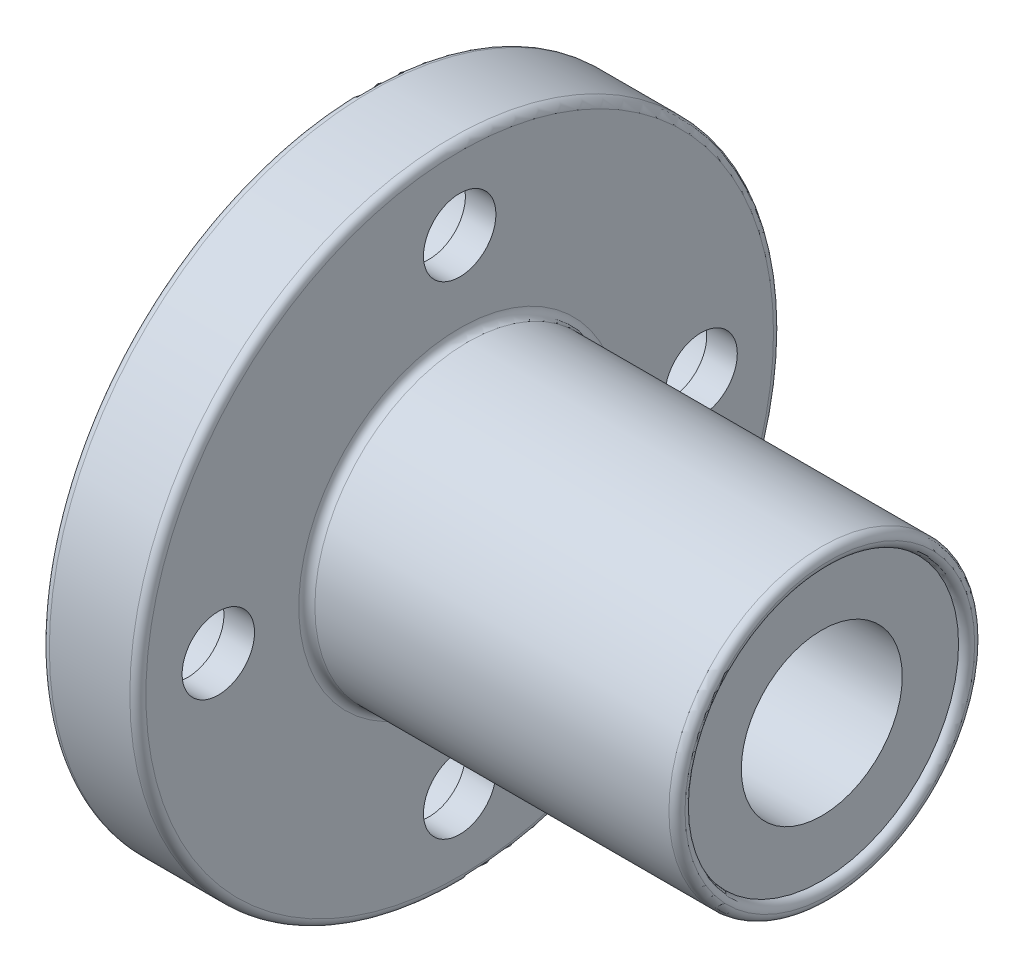
ISO-10303-21;
HEADER;
FILE_DESCRIPTION(('STEP AP214'),'2;1');
FILE_NAME('part.step','',(''),(''),'','','');
FILE_SCHEMA(('AUTOMOTIVE_DESIGN { 1 0 10303 214 1 1 1 1 }'));
ENDSEC;
DATA;
#1=APPLICATION_CONTEXT('core data for automotive mechanical design processes');
#2=APPLICATION_PROTOCOL_DEFINITION('international standard','automotive_design',2000,#1);
#3=PRODUCT_CONTEXT('',#1,'mechanical');
#4=PRODUCT('Part','Part','',(#3));
#5=PRODUCT_RELATED_PRODUCT_CATEGORY('part','',(#4));
#6=PRODUCT_DEFINITION_FORMATION('','',#4);
#7=PRODUCT_DEFINITION_CONTEXT('part definition',#1,'design');
#8=PRODUCT_DEFINITION('design','',#6,#7);
#9=PRODUCT_DEFINITION_SHAPE('','',#8);
#10=(LENGTH_UNIT() NAMED_UNIT(*) SI_UNIT(.MILLI.,.METRE.));
#11=(NAMED_UNIT(*) PLANE_ANGLE_UNIT() SI_UNIT($,.RADIAN.));
#12=(NAMED_UNIT(*) SI_UNIT($,.STERADIAN.) SOLID_ANGLE_UNIT());
#13=UNCERTAINTY_MEASURE_WITH_UNIT(LENGTH_MEASURE(1.E-05),#10,'distance_accuracy_value','');
#14=(GEOMETRIC_REPRESENTATION_CONTEXT(3) GLOBAL_UNCERTAINTY_ASSIGNED_CONTEXT((#13)) GLOBAL_UNIT_ASSIGNED_CONTEXT((#10,
#11,#12)) REPRESENTATION_CONTEXT('',''));
#15=CARTESIAN_POINT('',(0.,0.,0.));
#16=DIRECTION('',(0.,0.,1.));
#17=DIRECTION('',(1.,0.,0.));
#18=AXIS2_PLACEMENT_3D('',#15,#16,#17);
#19=CARTESIAN_POINT('',(6.,0.,0.));
#20=DIRECTION('',(-1.,0.,0.));
#21=DIRECTION('',(0.,0.,1.));
#22=AXIS2_PLACEMENT_3D('',#19,#20,#21);
#23=CYLINDRICAL_SURFACE('',#22,5.);
#24=CARTESIAN_POINT('',(28.5,0.,0.));
#25=DIRECTION('',(1.,0.,0.));
#26=DIRECTION('',(0.,0.,-1.));
#27=AXIS2_PLACEMENT_3D('',#24,#25,#26);
#28=CIRCLE('',#27,5.);
#29=CARTESIAN_POINT('',(28.5,0.,-5.));
#30=VERTEX_POINT('',#29);
#31=EDGE_CURVE('E85',#30,#30,#28,.T.);
#32=ORIENTED_EDGE('',*,*,#31,.T.);
#33=EDGE_LOOP('',(#32));
#34=FACE_BOUND('',#33,.T.);
#35=CARTESIAN_POINT('',(0.5,0.,0.));
#36=DIRECTION('',(-1.,0.,0.));
#37=DIRECTION('',(0.,0.,1.));
#38=AXIS2_PLACEMENT_3D('',#35,#36,#37);
#39=CIRCLE('',#38,5.);
#40=CARTESIAN_POINT('',(0.5,0.,5.));
#41=VERTEX_POINT('',#40);
#42=EDGE_CURVE('E67',#41,#41,#39,.T.);
#43=ORIENTED_EDGE('',*,*,#42,.T.);
#44=EDGE_LOOP('',(#43));
#45=FACE_BOUND('',#44,.T.);
#46=ADVANCED_FACE('F63',(#34,#45),#23,.F.);
#47=CARTESIAN_POINT('',(14.1,1.57116660247941E-13,-15.));
#48=DIRECTION('',(-1.,0.,0.));
#49=DIRECTION('',(0.,0.,1.));
#50=AXIS2_PLACEMENT_3D('',#47,#48,#49);
#51=CYLINDRICAL_SURFACE('',#50,2.25);
#52=CARTESIAN_POINT('',(6.,1.57116660247941E-13,-15.));
#53=DIRECTION('',(1.,0.,0.));
#54=DIRECTION('',(0.,0.,-1.));
#55=AXIS2_PLACEMENT_3D('',#52,#53,#54);
#56=CIRCLE('',#55,2.25);
#57=CARTESIAN_POINT('',(6.,1.57116660247941E-13,-17.25));
#58=VERTEX_POINT('',#57);
#59=EDGE_CURVE('E107',#58,#58,#56,.T.);
#60=ORIENTED_EDGE('',*,*,#59,.T.);
#61=EDGE_LOOP('',(#60));
#62=FACE_BOUND('',#61,.T.);
#63=CARTESIAN_POINT('',(4.1,1.57116660247941E-13,-15.));
#64=DIRECTION('',(-1.,0.,0.));
#65=DIRECTION('',(0.,0.,1.));
#66=AXIS2_PLACEMENT_3D('',#63,#64,#65);
#67=CIRCLE('',#66,2.25);
#68=CARTESIAN_POINT('',(4.1,1.57116660247941E-13,-12.75));
#69=VERTEX_POINT('',#68);
#70=EDGE_CURVE('E125',#69,#69,#67,.T.);
#71=ORIENTED_EDGE('',*,*,#70,.T.);
#72=EDGE_LOOP('',(#71));
#73=FACE_BOUND('',#72,.T.);
#74=ADVANCED_FACE('F181',(#62,#73),#51,.F.);
#75=CARTESIAN_POINT('',(14.1,15.,0.));
#76=DIRECTION('',(-1.,0.,0.));
#77=DIRECTION('',(0.,0.,1.));
#78=AXIS2_PLACEMENT_3D('',#75,#76,#77);
#79=CYLINDRICAL_SURFACE('',#78,2.25);
#80=CARTESIAN_POINT('',(6.,15.,0.));
#81=DIRECTION('',(1.,0.,0.));
#82=DIRECTION('',(0.,0.,-1.));
#83=AXIS2_PLACEMENT_3D('',#80,#81,#82);
#84=CIRCLE('',#83,2.25);
#85=CARTESIAN_POINT('',(6.,15.,-2.25));
#86=VERTEX_POINT('',#85);
#87=EDGE_CURVE('E138',#86,#86,#84,.T.);
#88=ORIENTED_EDGE('',*,*,#87,.T.);
#89=EDGE_LOOP('',(#88));
#90=FACE_BOUND('',#89,.T.);
#91=CARTESIAN_POINT('',(4.1,15.,0.));
#92=DIRECTION('',(-1.,0.,0.));
#93=DIRECTION('',(0.,0.,1.));
#94=AXIS2_PLACEMENT_3D('',#91,#92,#93);
#95=CIRCLE('',#94,2.25);
#96=CARTESIAN_POINT('',(4.1,15.,2.25));
#97=VERTEX_POINT('',#96);
#98=EDGE_CURVE('E116',#97,#97,#95,.T.);
#99=ORIENTED_EDGE('',*,*,#98,.T.);
#100=EDGE_LOOP('',(#99));
#101=FACE_BOUND('',#100,.T.);
#102=ADVANCED_FACE('F187',(#90,#101),#79,.F.);
#103=CARTESIAN_POINT('',(14.1,0.,15.));
#104=DIRECTION('',(-1.,0.,0.));
#105=DIRECTION('',(0.,0.,1.));
#106=AXIS2_PLACEMENT_3D('',#103,#104,#105);
#107=CYLINDRICAL_SURFACE('',#106,2.25);
#108=CARTESIAN_POINT('',(6.,0.,15.));
#109=DIRECTION('',(1.,0.,0.));
#110=DIRECTION('',(0.,0.,-1.));
#111=AXIS2_PLACEMENT_3D('',#108,#109,#110);
#112=CIRCLE('',#111,2.25);
#113=CARTESIAN_POINT('',(6.,0.,12.75));
#114=VERTEX_POINT('',#113);
#115=EDGE_CURVE('E141',#114,#114,#112,.T.);
#116=ORIENTED_EDGE('',*,*,#115,.T.);
#117=EDGE_LOOP('',(#116));
#118=FACE_BOUND('',#117,.T.);
#119=CARTESIAN_POINT('',(4.1,0.,15.));
#120=DIRECTION('',(-1.,0.,0.));
#121=DIRECTION('',(0.,0.,1.));
#122=AXIS2_PLACEMENT_3D('',#119,#120,#121);
#123=CIRCLE('',#122,2.25);
#124=CARTESIAN_POINT('',(4.1,0.,17.25));
#125=VERTEX_POINT('',#124);
#126=EDGE_CURVE('E103',#125,#125,#123,.T.);
#127=ORIENTED_EDGE('',*,*,#126,.T.);
#128=EDGE_LOOP('',(#127));
#129=FACE_BOUND('',#128,.T.);
#130=ADVANCED_FACE('F231',(#118,#129),#107,.F.);
#131=CARTESIAN_POINT('',(14.1,-15.,-1.04744440165294E-13));
#132=DIRECTION('',(-1.,0.,0.));
#133=DIRECTION('',(0.,0.,1.));
#134=AXIS2_PLACEMENT_3D('',#131,#132,#133);
#135=CYLINDRICAL_SURFACE('',#134,2.25);
#136=CARTESIAN_POINT('',(6.,-15.,-1.04744440165294E-13));
#137=DIRECTION('',(1.,0.,0.));
#138=DIRECTION('',(0.,0.,-1.));
#139=AXIS2_PLACEMENT_3D('',#136,#137,#138);
#140=CIRCLE('',#139,2.25);
#141=CARTESIAN_POINT('',(6.,-15.,-2.2500000000001));
#142=VERTEX_POINT('',#141);
#143=EDGE_CURVE('E144',#142,#142,#140,.T.);
#144=ORIENTED_EDGE('',*,*,#143,.T.);
#145=EDGE_LOOP('',(#144));
#146=FACE_BOUND('',#145,.T.);
#147=CARTESIAN_POINT('',(4.1,-15.,-1.04744440165294E-13));
#148=DIRECTION('',(-1.,0.,0.));
#149=DIRECTION('',(0.,0.,1.));
#150=AXIS2_PLACEMENT_3D('',#147,#148,#149);
#151=CIRCLE('',#150,2.25);
#152=CARTESIAN_POINT('',(4.1,-15.,2.24999999999989));
#153=VERTEX_POINT('',#152);
#154=EDGE_CURVE('E99',#153,#153,#151,.T.);
#155=ORIENTED_EDGE('',*,*,#154,.T.);
#156=EDGE_LOOP('',(#155));
#157=FACE_BOUND('',#156,.T.);
#158=ADVANCED_FACE('F227',(#146,#157),#135,.F.);
#159=CARTESIAN_POINT('',(6.,0.,0.));
#160=DIRECTION('',(1.,0.,0.));
#161=DIRECTION('',(0.,0.,-1.));
#162=AXIS2_PLACEMENT_3D('',#159,#160,#161);
#163=PLANE('',#162);
#164=CARTESIAN_POINT('',(6.,0.,0.));
#165=DIRECTION('',(1.,0.,0.));
#166=DIRECTION('',(0.,0.,-1.));
#167=AXIS2_PLACEMENT_3D('',#164,#165,#166);
#168=CIRCLE('',#167,19.5);
#169=CARTESIAN_POINT('',(6.,0.,-19.5));
#170=VERTEX_POINT('',#169);
#171=EDGE_CURVE('E76',#170,#170,#168,.T.);
#172=ORIENTED_EDGE('',*,*,#171,.T.);
#173=EDGE_LOOP('',(#172));
#174=FACE_BOUND('',#173,.T.);
#175=CARTESIAN_POINT('',(6.,0.,0.));
#176=DIRECTION('',(1.,0.,0.));
#177=DIRECTION('',(0.,0.,-1.));
#178=AXIS2_PLACEMENT_3D('',#175,#176,#177);
#179=CIRCLE('',#178,10.);
#180=CARTESIAN_POINT('',(6.,0.,-10.));
#181=VERTEX_POINT('',#180);
#182=EDGE_CURVE('E158',#181,#181,#179,.F.);
#183=ORIENTED_EDGE('',*,*,#182,.T.);
#184=EDGE_LOOP('',(#183));
#185=FACE_BOUND('',#184,.T.);
#186=ORIENTED_EDGE('',*,*,#143,.F.);
#187=EDGE_LOOP('',(#186));
#188=FACE_BOUND('',#187,.T.);
#189=ORIENTED_EDGE('',*,*,#115,.F.);
#190=EDGE_LOOP('',(#189));
#191=FACE_BOUND('',#190,.T.);
#192=ORIENTED_EDGE('',*,*,#87,.F.);
#193=EDGE_LOOP('',(#192));
#194=FACE_BOUND('',#193,.T.);
#195=ORIENTED_EDGE('',*,*,#59,.F.);
#196=EDGE_LOOP('',(#195));
#197=FACE_BOUND('',#196,.T.);
#198=ADVANCED_FACE('F163',(#174,#185,#188,#191,#194,#197),#163,.T.);
#199=CARTESIAN_POINT('',(6.,0.,0.));
#200=DIRECTION('',(-1.,0.,0.));
#201=DIRECTION('',(0.,0.,1.));
#202=AXIS2_PLACEMENT_3D('',#199,#200,#201);
#203=CYLINDRICAL_SURFACE('',#202,20.);
#204=CARTESIAN_POINT('',(0.5,0.,0.));
#205=DIRECTION('',(1.,0.,0.));
#206=DIRECTION('',(0.,0.,-1.));
#207=AXIS2_PLACEMENT_3D('',#204,#205,#206);
#208=CIRCLE('',#207,20.);
#209=CARTESIAN_POINT('',(0.5,0.,-20.));
#210=VERTEX_POINT('',#209);
#211=EDGE_CURVE('E152',#210,#210,#208,.T.);
#212=ORIENTED_EDGE('',*,*,#211,.T.);
#213=EDGE_LOOP('',(#212));
#214=FACE_BOUND('',#213,.T.);
#215=CARTESIAN_POINT('',(5.5,0.,0.));
#216=DIRECTION('',(1.,0.,0.));
#217=DIRECTION('',(0.,0.,-1.));
#218=AXIS2_PLACEMENT_3D('',#215,#216,#217);
#219=CIRCLE('',#218,20.);
#220=CARTESIAN_POINT('',(5.5,0.,-20.));
#221=VERTEX_POINT('',#220);
#222=EDGE_CURVE('E147',#221,#221,#219,.F.);
#223=ORIENTED_EDGE('',*,*,#222,.T.);
#224=EDGE_LOOP('',(#223));
#225=FACE_BOUND('',#224,.T.);
#226=ADVANCED_FACE('F194',(#214,#225),#203,.T.);
#227=CARTESIAN_POINT('',(0.,0.,0.));
#228=DIRECTION('',(1.,0.,0.));
#229=DIRECTION('',(0.,0.,-1.));
#230=AXIS2_PLACEMENT_3D('',#227,#228,#229);
#231=PLANE('',#230);
#232=CARTESIAN_POINT('',(0.,0.,0.));
#233=DIRECTION('',(1.,0.,0.));
#234=DIRECTION('',(0.,0.,-1.));
#235=AXIS2_PLACEMENT_3D('',#232,#233,#234);
#236=CIRCLE('',#235,8.5);
#237=CARTESIAN_POINT('',(0.,0.,-8.5));
#238=VERTEX_POINT('',#237);
#239=EDGE_CURVE('E92',#238,#238,#236,.T.);
#240=ORIENTED_EDGE('',*,*,#239,.T.);
#241=EDGE_LOOP('',(#240));
#242=FACE_BOUND('',#241,.T.);
#243=CARTESIAN_POINT('',(0.,0.,0.));
#244=DIRECTION('',(1.,0.,0.));
#245=DIRECTION('',(0.,0.,-1.));
#246=AXIS2_PLACEMENT_3D('',#243,#244,#245);
#247=CIRCLE('',#246,19.5);
#248=CARTESIAN_POINT('',(0.,0.,-19.5));
#249=VERTEX_POINT('',#248);
#250=EDGE_CURVE('E155',#249,#249,#247,.F.);
#251=ORIENTED_EDGE('',*,*,#250,.T.);
#252=EDGE_LOOP('',(#251));
#253=FACE_BOUND('',#252,.T.);
#254=CARTESIAN_POINT('',(0.,-15.,-1.04744440165294E-13));
#255=DIRECTION('',(-1.,0.,0.));
#256=DIRECTION('',(0.,0.,1.));
#257=AXIS2_PLACEMENT_3D('',#254,#255,#256);
#258=CIRCLE('',#257,3.75);
#259=CARTESIAN_POINT('',(0.,-15.,3.74999999999989));
#260=VERTEX_POINT('',#259);
#261=EDGE_CURVE('E102',#260,#260,#258,.T.);
#262=ORIENTED_EDGE('',*,*,#261,.F.);
#263=EDGE_LOOP('',(#262));
#264=FACE_BOUND('',#263,.T.);
#265=CARTESIAN_POINT('',(0.,0.,15.));
#266=DIRECTION('',(-1.,0.,0.));
#267=DIRECTION('',(0.,0.,1.));
#268=AXIS2_PLACEMENT_3D('',#265,#266,#267);
#269=CIRCLE('',#268,3.75);
#270=CARTESIAN_POINT('',(0.,0.,18.75));
#271=VERTEX_POINT('',#270);
#272=EDGE_CURVE('E110',#271,#271,#269,.T.);
#273=ORIENTED_EDGE('',*,*,#272,.F.);
#274=EDGE_LOOP('',(#273));
#275=FACE_BOUND('',#274,.T.);
#276=CARTESIAN_POINT('',(0.,15.,0.));
#277=DIRECTION('',(-1.,0.,0.));
#278=DIRECTION('',(0.,0.,1.));
#279=AXIS2_PLACEMENT_3D('',#276,#277,#278);
#280=CIRCLE('',#279,3.75);
#281=CARTESIAN_POINT('',(0.,15.,3.75));
#282=VERTEX_POINT('',#281);
#283=EDGE_CURVE('E119',#282,#282,#280,.T.);
#284=ORIENTED_EDGE('',*,*,#283,.F.);
#285=EDGE_LOOP('',(#284));
#286=FACE_BOUND('',#285,.T.);
#287=CARTESIAN_POINT('',(0.,1.57116660247941E-13,-15.));
#288=DIRECTION('',(-1.,0.,0.));
#289=DIRECTION('',(0.,0.,1.));
#290=AXIS2_PLACEMENT_3D('',#287,#288,#289);
#291=CIRCLE('',#290,3.75);
#292=CARTESIAN_POINT('',(0.,1.57116660247941E-13,-11.25));
#293=VERTEX_POINT('',#292);
#294=EDGE_CURVE('E128',#293,#293,#291,.T.);
#295=ORIENTED_EDGE('',*,*,#294,.F.);
#296=EDGE_LOOP('',(#295));
#297=FACE_BOUND('',#296,.T.);
#298=ADVANCED_FACE('F192',(#242,#253,#264,#275,#286,#297),#231,.F.);
#299=CARTESIAN_POINT('',(29.,0.,0.));
#300=DIRECTION('',(-1.,0.,0.));
#301=DIRECTION('',(0.,0.,1.));
#302=AXIS2_PLACEMENT_3D('',#299,#300,#301);
#303=CYLINDRICAL_SURFACE('',#302,9.5);
#304=CARTESIAN_POINT('',(6.5,0.,0.));
#305=DIRECTION('',(1.,0.,0.));
#306=DIRECTION('',(0.,0.,-1.));
#307=AXIS2_PLACEMENT_3D('',#304,#305,#306);
#308=CIRCLE('',#307,9.5);
#309=CARTESIAN_POINT('',(6.5,0.,9.5));
#310=VERTEX_POINT('',#309);
#311=EDGE_CURVE('E11',#310,#310,#308,.T.);
#312=CARTESIAN_POINT('',(28.5,0.,0.));
#313=DIRECTION('',(1.,0.,0.));
#314=DIRECTION('',(0.,0.,-1.));
#315=AXIS2_PLACEMENT_3D('',#312,#313,#314);
#316=CIRCLE('',#315,9.5);
#317=CARTESIAN_POINT('',(28.5,0.,9.5));
#318=VERTEX_POINT('',#317);
#319=EDGE_CURVE('E71',#318,#318,#316,.F.);
#320=CARTESIAN_POINT('',(6.5,0.,9.5));
#321=CARTESIAN_POINT('',(6.72916666666667,0.,9.5));
#322=CARTESIAN_POINT('',(6.95833333333333,0.,9.5));
#323=CARTESIAN_POINT('',(7.41666666666667,0.,9.5));
#324=CARTESIAN_POINT('',(7.64583333333333,0.,9.5));
#325=CARTESIAN_POINT('',(8.10416666666667,0.,9.5));
#326=CARTESIAN_POINT('',(8.33333333333333,0.,9.5));
#327=CARTESIAN_POINT('',(8.79166666666667,0.,9.5));
#328=CARTESIAN_POINT('',(9.02083333333333,0.,9.5));
#329=CARTESIAN_POINT('',(9.47916666666667,0.,9.5));
#330=CARTESIAN_POINT('',(9.70833333333333,0.,9.5));
#331=CARTESIAN_POINT('',(10.1666666666667,0.,9.5));
#332=CARTESIAN_POINT('',(10.3958333333333,0.,9.5));
#333=CARTESIAN_POINT('',(10.8541666666667,0.,9.5));
#334=CARTESIAN_POINT('',(11.0833333333333,0.,9.5));
#335=CARTESIAN_POINT('',(11.5416666666667,0.,9.5));
#336=CARTESIAN_POINT('',(11.7708333333333,0.,9.5));
#337=CARTESIAN_POINT('',(12.2291666666667,0.,9.5));
#338=CARTESIAN_POINT('',(12.4583333333333,0.,9.5));
#339=CARTESIAN_POINT('',(12.9166666666667,0.,9.5));
#340=CARTESIAN_POINT('',(13.1458333333333,0.,9.5));
#341=CARTESIAN_POINT('',(13.6041666666667,0.,9.5));
#342=CARTESIAN_POINT('',(13.8333333333333,0.,9.5));
#343=CARTESIAN_POINT('',(14.2916666666667,0.,9.5));
#344=CARTESIAN_POINT('',(14.5208333333333,0.,9.5));
#345=CARTESIAN_POINT('',(14.9791666666667,0.,9.5));
#346=CARTESIAN_POINT('',(15.2083333333333,0.,9.5));
#347=CARTESIAN_POINT('',(15.6666666666667,0.,9.5));
#348=CARTESIAN_POINT('',(15.8958333333333,0.,9.5));
#349=CARTESIAN_POINT('',(16.3541666666667,0.,9.5));
#350=CARTESIAN_POINT('',(16.5833333333333,0.,9.5));
#351=CARTESIAN_POINT('',(17.0416666666667,0.,9.5));
#352=CARTESIAN_POINT('',(17.2708333333333,0.,9.5));
#353=CARTESIAN_POINT('',(17.7291666666667,0.,9.5));
#354=CARTESIAN_POINT('',(17.9583333333333,0.,9.5));
#355=CARTESIAN_POINT('',(18.4166666666667,0.,9.5));
#356=CARTESIAN_POINT('',(18.6458333333333,0.,9.5));
#357=CARTESIAN_POINT('',(19.1041666666667,0.,9.5));
#358=CARTESIAN_POINT('',(19.3333333333333,0.,9.5));
#359=CARTESIAN_POINT('',(19.7916666666667,0.,9.5));
#360=CARTESIAN_POINT('',(20.0208333333333,0.,9.5));
#361=CARTESIAN_POINT('',(20.4791666666667,0.,9.5));
#362=CARTESIAN_POINT('',(20.7083333333333,0.,9.5));
#363=CARTESIAN_POINT('',(21.1666666666667,0.,9.5));
#364=CARTESIAN_POINT('',(21.3958333333333,0.,9.5));
#365=CARTESIAN_POINT('',(21.8541666666667,0.,9.5));
#366=CARTESIAN_POINT('',(22.0833333333333,0.,9.5));
#367=CARTESIAN_POINT('',(22.5416666666667,0.,9.5));
#368=CARTESIAN_POINT('',(22.7708333333333,0.,9.5));
#369=CARTESIAN_POINT('',(23.2291666666667,0.,9.5));
#370=CARTESIAN_POINT('',(23.4583333333333,0.,9.5));
#371=CARTESIAN_POINT('',(23.9166666666667,0.,9.5));
#372=CARTESIAN_POINT('',(24.1458333333333,0.,9.5));
#373=CARTESIAN_POINT('',(24.6041666666667,0.,9.5));
#374=CARTESIAN_POINT('',(24.8333333333333,0.,9.5));
#375=CARTESIAN_POINT('',(25.2916666666667,0.,9.5));
#376=CARTESIAN_POINT('',(25.5208333333333,0.,9.5));
#377=CARTESIAN_POINT('',(25.9791666666667,0.,9.5));
#378=CARTESIAN_POINT('',(26.2083333333333,0.,9.5));
#379=CARTESIAN_POINT('',(26.6666666666667,0.,9.5));
#380=CARTESIAN_POINT('',(26.8958333333333,0.,9.5));
#381=CARTESIAN_POINT('',(27.3541666666667,0.,9.5));
#382=CARTESIAN_POINT('',(27.5833333333333,0.,9.5));
#383=CARTESIAN_POINT('',(28.0416666666667,0.,9.5));
#384=CARTESIAN_POINT('',(28.2708333333333,0.,9.5));
#385=CARTESIAN_POINT('',(28.5,0.,9.5));
#386=B_SPLINE_CURVE_WITH_KNOTS('',3,(#320,#321,#322,#323,#324,#325,#326,#327,#328,#329,#330,
#331,#332,#333,#334,#335,#336,#337,#338,#339,#340,#341,#342,#343,#344,#345,#346,#347,#348,#349,
#350,#351,#352,#353,#354,#355,#356,#357,#358,#359,#360,#361,#362,#363,#364,#365,#366,#367,#368,
#369,#370,#371,#372,#373,#374,#375,#376,#377,#378,#379,#380,#381,#382,#383,#384,#385),
.UNSPECIFIED.,.F.,.F.,(4,2,2,2,2,2,2,2,2,2,2,2,2,2,2,2,2,2,2,2,2,2,2,2,2,2,2,2,2,2,2,2,4),(0.,
0.687500000000001,1.375,2.0625,2.75,3.4375,4.125,4.8125,5.5,6.1875,6.875,7.5625,8.25,8.9375,
9.625,10.3125,11.,11.6875,12.375,13.0625,13.75,14.4375,15.125,15.8125,16.5,17.1875,17.875,
18.5625,19.25,19.9375,20.625,21.3125,22.),.UNSPECIFIED.);
#387=EDGE_CURVE('BSEAM213',#310,#318,#386,.T.);
#388=ORIENTED_EDGE('',*,*,#311,.T.);
#389=ORIENTED_EDGE('',*,*,#319,.T.);
#390=ORIENTED_EDGE('',*,*,#387,.T.);
#391=ORIENTED_EDGE('',*,*,#387,.F.);
#392=EDGE_LOOP('',(#388,#390,#389,#391));
#393=FACE_BOUND('',#392,.T.);
#394=ADVANCED_FACE('F213',(#393),#303,.T.);
#395=CARTESIAN_POINT('',(4.1,-15.,-1.04744440165294E-13));
#396=DIRECTION('',(-1.,0.,0.));
#397=DIRECTION('',(0.,0.,1.));
#398=AXIS2_PLACEMENT_3D('',#395,#396,#397);
#399=CYLINDRICAL_SURFACE('',#398,3.75);
#400=CARTESIAN_POINT('',(4.1,-15.,-1.04744440165294E-13));
#401=DIRECTION('',(-1.,0.,0.));
#402=DIRECTION('',(0.,0.,1.));
#403=AXIS2_PLACEMENT_3D('',#400,#401,#402);
#404=CIRCLE('',#403,3.75);
#405=CARTESIAN_POINT('',(4.1,-15.,3.74999999999989));
#406=VERTEX_POINT('',#405);
#407=EDGE_CURVE('E104',#406,#406,#404,.T.);
#408=ORIENTED_EDGE('',*,*,#407,.F.);
#409=EDGE_LOOP('',(#408));
#410=FACE_BOUND('',#409,.T.);
#411=ORIENTED_EDGE('',*,*,#261,.T.);
#412=EDGE_LOOP('',(#411));
#413=FACE_BOUND('',#412,.T.);
#414=ADVANCED_FACE('F215',(#410,#413),#399,.F.);
#415=CARTESIAN_POINT('',(4.1,-15.,-1.04744440165294E-13));
#416=DIRECTION('',(-1.,0.,0.));
#417=DIRECTION('',(0.,0.,1.));
#418=AXIS2_PLACEMENT_3D('',#415,#416,#417);
#419=PLANE('',#418);
#420=ORIENTED_EDGE('',*,*,#154,.F.);
#421=EDGE_LOOP('',(#420));
#422=FACE_BOUND('',#421,.T.);
#423=ORIENTED_EDGE('',*,*,#407,.T.);
#424=EDGE_LOOP('',(#423));
#425=FACE_BOUND('',#424,.T.);
#426=ADVANCED_FACE('F221',(#422,#425),#419,.T.);
#427=CARTESIAN_POINT('',(4.1,0.,15.));
#428=DIRECTION('',(-1.,0.,0.));
#429=DIRECTION('',(0.,0.,1.));
#430=AXIS2_PLACEMENT_3D('',#427,#428,#429);
#431=CYLINDRICAL_SURFACE('',#430,3.75);
#432=CARTESIAN_POINT('',(4.1,0.,15.));
#433=DIRECTION('',(-1.,0.,0.));
#434=DIRECTION('',(0.,0.,1.));
#435=AXIS2_PLACEMENT_3D('',#432,#433,#434);
#436=CIRCLE('',#435,3.75);
#437=CARTESIAN_POINT('',(4.1,0.,18.75));
#438=VERTEX_POINT('',#437);
#439=EDGE_CURVE('E113',#438,#438,#436,.T.);
#440=ORIENTED_EDGE('',*,*,#439,.F.);
#441=EDGE_LOOP('',(#440));
#442=FACE_BOUND('',#441,.T.);
#443=ORIENTED_EDGE('',*,*,#272,.T.);
#444=EDGE_LOOP('',(#443));
#445=FACE_BOUND('',#444,.T.);
#446=ADVANCED_FACE('F277',(#442,#445),#431,.F.);
#447=CARTESIAN_POINT('',(4.1,0.,15.));
#448=DIRECTION('',(-1.,0.,0.));
#449=DIRECTION('',(0.,0.,1.));
#450=AXIS2_PLACEMENT_3D('',#447,#448,#449);
#451=PLANE('',#450);
#452=ORIENTED_EDGE('',*,*,#126,.F.);
#453=EDGE_LOOP('',(#452));
#454=FACE_BOUND('',#453,.T.);
#455=ORIENTED_EDGE('',*,*,#439,.T.);
#456=EDGE_LOOP('',(#455));
#457=FACE_BOUND('',#456,.T.);
#458=ADVANCED_FACE('F260',(#454,#457),#451,.T.);
#459=CARTESIAN_POINT('',(4.1,15.,0.));
#460=DIRECTION('',(-1.,0.,0.));
#461=DIRECTION('',(0.,0.,1.));
#462=AXIS2_PLACEMENT_3D('',#459,#460,#461);
#463=CYLINDRICAL_SURFACE('',#462,3.75);
#464=CARTESIAN_POINT('',(4.1,15.,0.));
#465=DIRECTION('',(-1.,0.,0.));
#466=DIRECTION('',(0.,0.,1.));
#467=AXIS2_PLACEMENT_3D('',#464,#465,#466);
#468=CIRCLE('',#467,3.75);
#469=CARTESIAN_POINT('',(4.1,15.,3.75));
#470=VERTEX_POINT('',#469);
#471=EDGE_CURVE('E122',#470,#470,#468,.T.);
#472=ORIENTED_EDGE('',*,*,#471,.F.);
#473=EDGE_LOOP('',(#472));
#474=FACE_BOUND('',#473,.T.);
#475=ORIENTED_EDGE('',*,*,#283,.T.);
#476=EDGE_LOOP('',(#475));
#477=FACE_BOUND('',#476,.T.);
#478=ADVANCED_FACE('F254',(#474,#477),#463,.F.);
#479=CARTESIAN_POINT('',(4.1,15.,0.));
#480=DIRECTION('',(-1.,0.,0.));
#481=DIRECTION('',(0.,0.,1.));
#482=AXIS2_PLACEMENT_3D('',#479,#480,#481);
#483=PLANE('',#482);
#484=ORIENTED_EDGE('',*,*,#98,.F.);
#485=EDGE_LOOP('',(#484));
#486=FACE_BOUND('',#485,.T.);
#487=ORIENTED_EDGE('',*,*,#471,.T.);
#488=EDGE_LOOP('',(#487));
#489=FACE_BOUND('',#488,.T.);
#490=ADVANCED_FACE('F250',(#486,#489),#483,.T.);
#491=CARTESIAN_POINT('',(4.1,1.57116660247941E-13,-15.));
#492=DIRECTION('',(-1.,0.,0.));
#493=DIRECTION('',(0.,0.,1.));
#494=AXIS2_PLACEMENT_3D('',#491,#492,#493);
#495=CYLINDRICAL_SURFACE('',#494,3.75);
#496=CARTESIAN_POINT('',(4.1,1.57116660247941E-13,-15.));
#497=DIRECTION('',(-1.,0.,0.));
#498=DIRECTION('',(0.,0.,1.));
#499=AXIS2_PLACEMENT_3D('',#496,#497,#498);
#500=CIRCLE('',#499,3.75);
#501=CARTESIAN_POINT('',(4.1,1.57116660247941E-13,-11.25));
#502=VERTEX_POINT('',#501);
#503=EDGE_CURVE('E131',#502,#502,#500,.T.);
#504=ORIENTED_EDGE('',*,*,#503,.F.);
#505=EDGE_LOOP('',(#504));
#506=FACE_BOUND('',#505,.T.);
#507=ORIENTED_EDGE('',*,*,#294,.T.);
#508=EDGE_LOOP('',(#507));
#509=FACE_BOUND('',#508,.T.);
#510=ADVANCED_FACE('F253',(#506,#509),#495,.F.);
#511=CARTESIAN_POINT('',(4.1,1.57116660247941E-13,-15.));
#512=DIRECTION('',(-1.,0.,0.));
#513=DIRECTION('',(0.,0.,1.));
#514=AXIS2_PLACEMENT_3D('',#511,#512,#513);
#515=PLANE('',#514);
#516=ORIENTED_EDGE('',*,*,#70,.F.);
#517=EDGE_LOOP('',(#516));
#518=FACE_BOUND('',#517,.T.);
#519=ORIENTED_EDGE('',*,*,#503,.T.);
#520=EDGE_LOOP('',(#519));
#521=FACE_BOUND('',#520,.T.);
#522=ADVANCED_FACE('F207',(#518,#521),#515,.T.);
#523=CARTESIAN_POINT('',(28.5,0.,0.));
#524=DIRECTION('',(1.,0.,0.));
#525=DIRECTION('',(0.,0.,-1.));
#526=AXIS2_PLACEMENT_3D('',#523,#524,#525);
#527=PLANE('',#526);
#528=ORIENTED_EDGE('',*,*,#31,.F.);
#529=EDGE_LOOP('',(#528));
#530=FACE_BOUND('',#529,.T.);
#531=CARTESIAN_POINT('',(28.5,0.,0.));
#532=DIRECTION('',(1.,0.,0.));
#533=DIRECTION('',(0.,0.,-1.));
#534=AXIS2_PLACEMENT_3D('',#531,#532,#533);
#535=CIRCLE('',#534,8.5);
#536=CARTESIAN_POINT('',(28.5,0.,-8.5));
#537=VERTEX_POINT('',#536);
#538=EDGE_CURVE('E81',#537,#537,#535,.T.);
#539=ORIENTED_EDGE('',*,*,#538,.T.);
#540=EDGE_LOOP('',(#539));
#541=FACE_BOUND('',#540,.T.);
#542=ADVANCED_FACE('F202',(#530,#541),#527,.T.);
#543=CARTESIAN_POINT('',(28.5,0.,0.));
#544=DIRECTION('',(1.,0.,0.));
#545=DIRECTION('',(0.,0.,-1.));
#546=AXIS2_PLACEMENT_3D('',#543,#544,#545);
#547=TOROIDAL_SURFACE('',#546,9.,0.5);
#548=ORIENTED_EDGE('',*,*,#319,.F.);
#549=EDGE_LOOP('',(#548));
#550=FACE_BOUND('',#549,.T.);
#551=CARTESIAN_POINT('',(29.,0.,0.));
#552=DIRECTION('',(1.,0.,0.));
#553=DIRECTION('',(0.,0.,-1.));
#554=AXIS2_PLACEMENT_3D('',#551,#552,#553);
#555=CIRCLE('',#554,9.);
#556=CARTESIAN_POINT('',(29.,0.,-9.));
#557=VERTEX_POINT('',#556);
#558=EDGE_CURVE('E79',#557,#557,#555,.T.);
#559=ORIENTED_EDGE('',*,*,#558,.F.);
#560=EDGE_LOOP('',(#559));
#561=FACE_BOUND('',#560,.T.);
#562=ADVANCED_FACE('F200',(#550,#561),#547,.T.);
#563=CARTESIAN_POINT('',(28.5,0.,0.));
#564=DIRECTION('',(1.,0.,0.));
#565=DIRECTION('',(0.,0.,-1.));
#566=AXIS2_PLACEMENT_3D('',#563,#564,#565);
#567=TOROIDAL_SURFACE('',#566,9.,0.5);
#568=ORIENTED_EDGE('',*,*,#558,.T.);
#569=EDGE_LOOP('',(#568));
#570=FACE_BOUND('',#569,.T.);
#571=ORIENTED_EDGE('',*,*,#538,.F.);
#572=EDGE_LOOP('',(#571));
#573=FACE_BOUND('',#572,.T.);
#574=ADVANCED_FACE('F176',(#570,#573),#567,.T.);
#575=CARTESIAN_POINT('',(0.5,0.,0.));
#576=DIRECTION('',(1.,0.,0.));
#577=DIRECTION('',(0.,0.,-1.));
#578=AXIS2_PLACEMENT_3D('',#575,#576,#577);
#579=TOROIDAL_SURFACE('',#578,19.5,0.5);
#580=ORIENTED_EDGE('',*,*,#250,.F.);
#581=EDGE_LOOP('',(#580));
#582=FACE_BOUND('',#581,.T.);
#583=ORIENTED_EDGE('',*,*,#211,.F.);
#584=EDGE_LOOP('',(#583));
#585=FACE_BOUND('',#584,.T.);
#586=ADVANCED_FACE('F168',(#582,#585),#579,.T.);
#587=CARTESIAN_POINT('',(5.5,0.,0.));
#588=DIRECTION('',(1.,0.,0.));
#589=DIRECTION('',(0.,0.,-1.));
#590=AXIS2_PLACEMENT_3D('',#587,#588,#589);
#591=TOROIDAL_SURFACE('',#590,19.5,0.5);
#592=ORIENTED_EDGE('',*,*,#222,.F.);
#593=EDGE_LOOP('',(#592));
#594=FACE_BOUND('',#593,.T.);
#595=ORIENTED_EDGE('',*,*,#171,.F.);
#596=EDGE_LOOP('',(#595));
#597=FACE_BOUND('',#596,.T.);
#598=ADVANCED_FACE('F166',(#594,#597),#591,.T.);
#599=CARTESIAN_POINT('',(6.5,0.,0.));
#600=DIRECTION('',(1.,0.,0.));
#601=DIRECTION('',(0.,0.,-1.));
#602=AXIS2_PLACEMENT_3D('',#599,#600,#601);
#603=TOROIDAL_SURFACE('',#602,10.,0.5);
#604=ORIENTED_EDGE('',*,*,#311,.F.);
#605=EDGE_LOOP('',(#604));
#606=FACE_BOUND('',#605,.T.);
#607=ORIENTED_EDGE('',*,*,#182,.F.);
#608=EDGE_LOOP('',(#607));
#609=FACE_BOUND('',#608,.T.);
#610=ADVANCED_FACE('F65',(#606,#609),#603,.F.);
#611=CARTESIAN_POINT('',(0.5,0.,0.));
#612=DIRECTION('',(-1.,0.,0.));
#613=DIRECTION('',(0.,0.,1.));
#614=AXIS2_PLACEMENT_3D('',#611,#612,#613);
#615=CYLINDRICAL_SURFACE('',#614,8.5);
#616=CARTESIAN_POINT('',(0.5,0.,0.));
#617=DIRECTION('',(1.,0.,0.));
#618=DIRECTION('',(0.,0.,-1.));
#619=AXIS2_PLACEMENT_3D('',#616,#617,#618);
#620=CIRCLE('',#619,8.5);
#621=CARTESIAN_POINT('',(0.5,0.,-8.5));
#622=VERTEX_POINT('',#621);
#623=EDGE_CURVE('E88',#622,#622,#620,.T.);
#624=ORIENTED_EDGE('',*,*,#623,.T.);
#625=EDGE_LOOP('',(#624));
#626=FACE_BOUND('',#625,.T.);
#627=ORIENTED_EDGE('',*,*,#239,.F.);
#628=EDGE_LOOP('',(#627));
#629=FACE_BOUND('',#628,.T.);
#630=ADVANCED_FACE('F174',(#626,#629),#615,.F.);
#631=CARTESIAN_POINT('',(0.5,0.,0.));
#632=DIRECTION('',(-1.,0.,0.));
#633=DIRECTION('',(0.,0.,-1.));
#634=AXIS2_PLACEMENT_3D('',#631,#632,#633);
#635=PLANE('',#634);
#636=ORIENTED_EDGE('',*,*,#42,.F.);
#637=EDGE_LOOP('',(#636));
#638=FACE_BOUND('',#637,.T.);
#639=ORIENTED_EDGE('',*,*,#623,.F.);
#640=EDGE_LOOP('',(#639));
#641=FACE_BOUND('',#640,.T.);
#642=ADVANCED_FACE('F287',(#638,#641),#635,.T.);
#643=CLOSED_SHELL('',(#46,#74,#102,#130,#158,#198,#226,#298,#394,#414,#426,#446,#458,#478,#490,
#510,#522,#542,#562,#574,#586,#598,#610,#630,#642));
#644=MANIFOLD_SOLID_BREP('B2',#643);
#645=ADVANCED_BREP_SHAPE_REPRESENTATION('',(#18,#644),#14);
#646=SHAPE_DEFINITION_REPRESENTATION(#9,#645);
ENDSEC;
END-ISO-10303-21;
